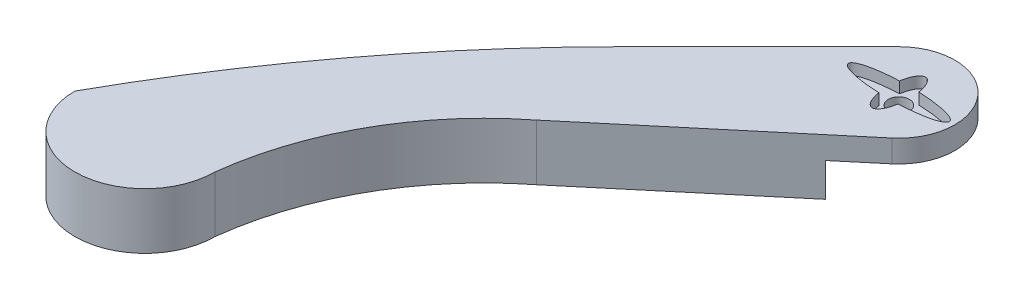
ISO-10303-21;
HEADER;
FILE_DESCRIPTION(('STEP AP214'),'2;1');
FILE_NAME('part.step','',(''),(''),'','','');
FILE_SCHEMA(('AUTOMOTIVE_DESIGN { 1 0 10303 214 1 1 1 1 }'));
ENDSEC;
DATA;
#1=APPLICATION_CONTEXT('core data for automotive mechanical design processes');
#2=APPLICATION_PROTOCOL_DEFINITION('international standard','automotive_design',2000,#1);
#3=PRODUCT_CONTEXT('',#1,'mechanical');
#4=PRODUCT('Part','Part','',(#3));
#5=PRODUCT_RELATED_PRODUCT_CATEGORY('part','',(#4));
#6=PRODUCT_DEFINITION_FORMATION('','',#4);
#7=PRODUCT_DEFINITION_CONTEXT('part definition',#1,'design');
#8=PRODUCT_DEFINITION('design','',#6,#7);
#9=PRODUCT_DEFINITION_SHAPE('','',#8);
#10=(LENGTH_UNIT() NAMED_UNIT(*) SI_UNIT(.MILLI.,.METRE.));
#11=(NAMED_UNIT(*) PLANE_ANGLE_UNIT() SI_UNIT($,.RADIAN.));
#12=(NAMED_UNIT(*) SI_UNIT($,.STERADIAN.) SOLID_ANGLE_UNIT());
#13=UNCERTAINTY_MEASURE_WITH_UNIT(LENGTH_MEASURE(1.E-05),#10,'distance_accuracy_value','');
#14=(GEOMETRIC_REPRESENTATION_CONTEXT(3) GLOBAL_UNCERTAINTY_ASSIGNED_CONTEXT((#13)) GLOBAL_UNIT_ASSIGNED_CONTEXT((#10,
#11,#12)) REPRESENTATION_CONTEXT('',''));
#15=CARTESIAN_POINT('',(0.,0.,0.));
#16=DIRECTION('',(0.,0.,1.));
#17=DIRECTION('',(1.,0.,0.));
#18=AXIS2_PLACEMENT_3D('',#15,#16,#17);
#19=CARTESIAN_POINT('',(0.,10.,0.));
#20=DIRECTION('',(0.,-1.,0.));
#21=DIRECTION('',(0.,0.,-1.));
#22=AXIS2_PLACEMENT_3D('',#19,#20,#21);
#23=CYLINDRICAL_SURFACE('',#22,20.);
#24=CARTESIAN_POINT('',(0.,2.,0.));
#25=DIRECTION('',(0.,-1.,0.));
#26=DIRECTION('',(0.,0.,-1.));
#27=AXIS2_PLACEMENT_3D('',#24,#25,#26);
#28=CIRCLE('',#27,20.);
#29=CARTESIAN_POINT('',(-14.1421356237309,2.,-14.142135623731));
#30=VERTEX_POINT('',#29);
#31=CARTESIAN_POINT('',(12.8557521937307,2.,15.3208888623796));
#32=VERTEX_POINT('',#31);
#33=EDGE_CURVE('E129',#30,#32,#28,.T.);
#34=ORIENTED_EDGE('',*,*,#33,.F.);
#35=DIRECTION('',(0.,-1.,0.));
#36=VECTOR('',#35,1.);
#37=CARTESIAN_POINT('',(-14.1421356237309,10.,-14.142135623731));
#38=LINE('',#37,#36);
#39=CARTESIAN_POINT('',(-14.1421356237309,10.,-14.142135623731));
#40=VERTEX_POINT('',#39);
#41=EDGE_CURVE('E155',#40,#30,#38,.T.);
#42=ORIENTED_EDGE('',*,*,#41,.F.);
#43=CARTESIAN_POINT('',(0.,10.,0.));
#44=DIRECTION('',(0.,1.,0.));
#45=DIRECTION('',(0.,0.,1.));
#46=AXIS2_PLACEMENT_3D('',#43,#44,#45);
#47=CIRCLE('',#46,20.);
#48=CARTESIAN_POINT('',(12.8557521937307,10.,15.3208888623796));
#49=VERTEX_POINT('',#48);
#50=EDGE_CURVE('E151',#49,#40,#47,.T.);
#51=ORIENTED_EDGE('',*,*,#50,.F.);
#52=DIRECTION('',(0.,-1.,0.));
#53=VECTOR('',#52,1.);
#54=CARTESIAN_POINT('',(12.8557521937307,10.,15.3208888623796));
#55=LINE('',#54,#53);
#56=EDGE_CURVE('E144',#49,#32,#55,.T.);
#57=ORIENTED_EDGE('',*,*,#56,.T.);
#58=EDGE_LOOP('',(#34,#42,#51,#57));
#59=FACE_BOUND('',#58,.T.);
#60=ADVANCED_FACE('F38',(#59),#23,.T.);
#61=CARTESIAN_POINT('',(0.,10.000012,0.));
#62=DIRECTION('',(0.,-1.,0.));
#63=DIRECTION('',(0.,0.,-1.));
#64=AXIS2_PLACEMENT_3D('',#61,#62,#63);
#65=CYLINDRICAL_SURFACE('',#64,3.75);
#66=CARTESIAN_POINT('',(0.,6.,0.));
#67=DIRECTION('',(0.,-1.,0.));
#68=DIRECTION('',(0.,0.,-1.));
#69=AXIS2_PLACEMENT_3D('',#66,#67,#68);
#70=CIRCLE('',#69,3.75);
#71=CARTESIAN_POINT('',(0.,6.,-3.75));
#72=VERTEX_POINT('',#71);
#73=EDGE_CURVE('E176',#72,#72,#70,.F.);
#74=ORIENTED_EDGE('',*,*,#73,.T.);
#75=EDGE_LOOP('',(#74));
#76=FACE_BOUND('',#75,.T.);
#77=CARTESIAN_POINT('',(0.,2.,0.));
#78=DIRECTION('',(0.,-1.,0.));
#79=DIRECTION('',(0.,0.,-1.));
#80=AXIS2_PLACEMENT_3D('',#77,#78,#79);
#81=CIRCLE('',#80,3.75);
#82=CARTESIAN_POINT('',(0.,2.,-3.75));
#83=VERTEX_POINT('',#82);
#84=EDGE_CURVE('E42',#83,#83,#81,.F.);
#85=ORIENTED_EDGE('',*,*,#84,.F.);
#86=EDGE_LOOP('',(#85));
#87=FACE_BOUND('',#86,.T.);
#88=ADVANCED_FACE('F291',(#76,#87),#65,.F.);
#89=CARTESIAN_POINT('',(-14.1421356237309,10.,-14.142135623731));
#90=DIRECTION('',(0.707106781186548,0.,0.707106781186547));
#91=DIRECTION('',(0.707106781186547,0.,-0.707106781186548));
#92=AXIS2_PLACEMENT_3D('',#89,#90,#91);
#93=PLANE('',#92);
#94=DIRECTION('',(0.707106781186547,0.,-0.707106781186548));
#95=VECTOR('',#94,1.);
#96=CARTESIAN_POINT('',(-14.1421356237309,2.,-14.142135623731));
#97=LINE('',#96,#95);
#98=CARTESIAN_POINT('',(-54.7968039019934,2.,26.5125326545314));
#99=VERTEX_POINT('',#98);
#100=EDGE_CURVE('E134',#99,#30,#97,.T.);
#101=ORIENTED_EDGE('',*,*,#100,.F.);
#102=DIRECTION('',(0.,-1.,0.));
#103=VECTOR('',#102,1.);
#104=CARTESIAN_POINT('',(-54.7968039019934,2.,26.5125326545314));
#105=LINE('',#104,#103);
#106=CARTESIAN_POINT('',(-54.7968039019934,-10.,26.5125326545314));
#107=VERTEX_POINT('',#106);
#108=EDGE_CURVE('E267',#99,#107,#105,.T.);
#109=ORIENTED_EDGE('',*,*,#108,.T.);
#110=DIRECTION('',(-0.707106781186547,0.,0.707106781186548));
#111=VECTOR('',#110,1.);
#112=CARTESIAN_POINT('',(-14.1421356237309,-10.,-14.142135623731));
#113=LINE('',#112,#111);
#114=CARTESIAN_POINT('',(-63.6396103067893,-10.,35.3553390593272));
#115=VERTEX_POINT('',#114);
#116=EDGE_CURVE('E180',#107,#115,#113,.T.);
#117=ORIENTED_EDGE('',*,*,#116,.T.);
#118=DIRECTION('',(0.,-1.,0.));
#119=VECTOR('',#118,1.);
#120=CARTESIAN_POINT('',(-63.6396103067893,10.,35.3553390593272));
#121=LINE('',#120,#119);
#122=CARTESIAN_POINT('',(-63.6396103067893,10.,35.3553390593272));
#123=VERTEX_POINT('',#122);
#124=EDGE_CURVE('E171',#123,#115,#121,.T.);
#125=ORIENTED_EDGE('',*,*,#124,.F.);
#126=DIRECTION('',(-0.707106781186547,0.,0.707106781186548));
#127=VECTOR('',#126,1.);
#128=CARTESIAN_POINT('',(-14.1421356237309,10.,-14.142135623731));
#129=LINE('',#128,#127);
#130=EDGE_CURVE('E213',#40,#123,#129,.T.);
#131=ORIENTED_EDGE('',*,*,#130,.F.);
#132=ORIENTED_EDGE('',*,*,#41,.T.);
#133=EDGE_LOOP('',(#101,#109,#117,#125,#131,#132));
#134=FACE_BOUND('',#133,.T.);
#135=ADVANCED_FACE('F40',(#134),#93,.F.);
#136=CARTESIAN_POINT('',(289.913780286484,10.,388.908729652601));
#137=DIRECTION('',(0.,-1.,0.));
#138=DIRECTION('',(0.,0.,-1.));
#139=AXIS2_PLACEMENT_3D('',#136,#137,#138);
#140=CYLINDRICAL_SURFACE('',#139,500.);
#141=CARTESIAN_POINT('',(289.913780286484,-10.,388.908729652601));
#142=DIRECTION('',(0.,1.,0.));
#143=DIRECTION('',(0.,0.,1.));
#144=AXIS2_PLACEMENT_3D('',#141,#142,#143);
#145=CIRCLE('',#144,500.);
#146=CARTESIAN_POINT('',(-147.478482249993,-10.,146.652648876037));
#147=VERTEX_POINT('',#146);
#148=EDGE_CURVE('E235',#115,#147,#145,.T.);
#149=ORIENTED_EDGE('',*,*,#148,.T.);
#150=DIRECTION('',(0.,-1.,0.));
#151=VECTOR('',#150,1.);
#152=CARTESIAN_POINT('',(-147.478482249993,10.,146.652648876037));
#153=LINE('',#152,#151);
#154=CARTESIAN_POINT('',(-147.478482249993,10.,146.652648876037));
#155=VERTEX_POINT('',#154);
#156=EDGE_CURVE('E167',#155,#147,#153,.T.);
#157=ORIENTED_EDGE('',*,*,#156,.F.);
#158=CARTESIAN_POINT('',(289.913780286484,10.,388.908729652601));
#159=DIRECTION('',(0.,1.,0.));
#160=DIRECTION('',(0.,0.,1.));
#161=AXIS2_PLACEMENT_3D('',#158,#159,#160);
#162=CIRCLE('',#161,500.);
#163=EDGE_CURVE('E217',#123,#155,#162,.T.);
#164=ORIENTED_EDGE('',*,*,#163,.F.);
#165=ORIENTED_EDGE('',*,*,#124,.T.);
#166=EDGE_LOOP('',(#149,#157,#164,#165));
#167=FACE_BOUND('',#166,.T.);
#168=ADVANCED_FACE('F262',(#167),#140,.T.);
#169=CARTESIAN_POINT('',(-122.478482249993,10.,146.652648876037));
#170=DIRECTION('',(0.,-1.,0.));
#171=DIRECTION('',(0.,0.,-1.));
#172=AXIS2_PLACEMENT_3D('',#169,#170,#171);
#173=CYLINDRICAL_SURFACE('',#172,25.);
#174=CARTESIAN_POINT('',(-122.478482249993,-10.,146.652648876037));
#175=DIRECTION('',(0.,1.,0.));
#176=DIRECTION('',(0.,0.,1.));
#177=AXIS2_PLACEMENT_3D('',#174,#175,#176);
#178=CIRCLE('',#177,25.);
#179=CARTESIAN_POINT('',(-97.4784822499933,-10.,146.652648876037));
#180=VERTEX_POINT('',#179);
#181=EDGE_CURVE('E238',#147,#180,#178,.T.);
#182=ORIENTED_EDGE('',*,*,#181,.T.);
#183=DIRECTION('',(0.,-1.,0.));
#184=VECTOR('',#183,1.);
#185=CARTESIAN_POINT('',(-97.4784822499933,10.,146.652648876037));
#186=LINE('',#185,#184);
#187=CARTESIAN_POINT('',(-97.4784822499933,10.,146.652648876037));
#188=VERTEX_POINT('',#187);
#189=EDGE_CURVE('E160',#188,#180,#186,.T.);
#190=ORIENTED_EDGE('',*,*,#189,.F.);
#191=CARTESIAN_POINT('',(-122.478482249993,10.,146.652648876037));
#192=DIRECTION('',(0.,1.,0.));
#193=DIRECTION('',(0.,0.,1.));
#194=AXIS2_PLACEMENT_3D('',#191,#192,#193);
#195=CIRCLE('',#194,25.);
#196=EDGE_CURVE('E221',#155,#188,#195,.T.);
#197=ORIENTED_EDGE('',*,*,#196,.F.);
#198=ORIENTED_EDGE('',*,*,#156,.T.);
#199=EDGE_LOOP('',(#182,#190,#197,#198));
#200=FACE_BOUND('',#199,.T.);
#201=ADVANCED_FACE('F257',(#200),#173,.T.);
#202=CARTESIAN_POINT('',(11.7361932959104,10.,159.773420400722));
#203=DIRECTION('',(0.,-1.,0.));
#204=DIRECTION('',(0.,0.,-1.));
#205=AXIS2_PLACEMENT_3D('',#202,#203,#204);
#206=CYLINDRICAL_SURFACE('',#205,110.);
#207=CARTESIAN_POINT('',(11.7361932959104,-10.,159.773420400722));
#208=DIRECTION('',(0.,1.,0.));
#209=DIRECTION('',(0.,0.,1.));
#210=AXIS2_PLACEMENT_3D('',#207,#208,#209);
#211=CIRCLE('',#210,110.);
#212=CARTESIAN_POINT('',(-56.0882476869776,-10.,73.1717737341677));
#213=VERTEX_POINT('',#212);
#214=EDGE_CURVE('E242',#213,#180,#211,.T.);
#215=ORIENTED_EDGE('',*,*,#214,.F.);
#216=DIRECTION('',(0.,-1.,0.));
#217=VECTOR('',#216,1.);
#218=CARTESIAN_POINT('',(-56.0882476869776,10.,73.1717737341677));
#219=LINE('',#218,#217);
#220=CARTESIAN_POINT('',(-56.0882476869776,10.,73.1717737341677));
#221=VERTEX_POINT('',#220);
#222=EDGE_CURVE('E154',#221,#213,#219,.T.);
#223=ORIENTED_EDGE('',*,*,#222,.F.);
#224=CARTESIAN_POINT('',(11.7361932959104,10.,159.773420400722));
#225=DIRECTION('',(0.,1.,0.));
#226=DIRECTION('',(0.,0.,1.));
#227=AXIS2_PLACEMENT_3D('',#224,#225,#226);
#228=CIRCLE('',#227,110.);
#229=EDGE_CURVE('E224',#221,#188,#228,.T.);
#230=ORIENTED_EDGE('',*,*,#229,.T.);
#231=ORIENTED_EDGE('',*,*,#189,.T.);
#232=EDGE_LOOP('',(#215,#223,#230,#231));
#233=FACE_BOUND('',#232,.T.);
#234=ADVANCED_FACE('F253',(#233),#206,.F.);
#235=CARTESIAN_POINT('',(12.8557521937307,10.,15.3208888623796));
#236=DIRECTION('',(0.642787609686535,0.,0.766044443118982));
#237=DIRECTION('',(0.766044443118982,0.,-0.642787609686535));
#238=AXIS2_PLACEMENT_3D('',#235,#236,#237);
#239=PLANE('',#238);
#240=DIRECTION('',(0.,-1.,0.));
#241=VECTOR('',#240,1.);
#242=CARTESIAN_POINT('',(0.,2.,26.1081457866455));
#243=LINE('',#242,#241);
#244=CARTESIAN_POINT('',(0.,2.,26.1081457866455));
#245=VERTEX_POINT('',#244);
#246=CARTESIAN_POINT('',(0.,-10.,26.1081457866455));
#247=VERTEX_POINT('',#246);
#248=EDGE_CURVE('E55',#245,#247,#243,.T.);
#249=ORIENTED_EDGE('',*,*,#248,.F.);
#250=DIRECTION('',(0.766044443118982,0.,-0.642787609686535));
#251=VECTOR('',#250,1.);
#252=CARTESIAN_POINT('',(0.,2.,26.1081457866455));
#253=LINE('',#252,#251);
#254=EDGE_CURVE('E133',#245,#32,#253,.T.);
#255=ORIENTED_EDGE('',*,*,#254,.T.);
#256=ORIENTED_EDGE('',*,*,#56,.F.);
#257=DIRECTION('',(-0.766044443118982,0.,0.642787609686535));
#258=VECTOR('',#257,1.);
#259=CARTESIAN_POINT('',(12.8557521937307,10.,15.3208888623796));
#260=LINE('',#259,#258);
#261=EDGE_CURVE('E228',#49,#221,#260,.T.);
#262=ORIENTED_EDGE('',*,*,#261,.T.);
#263=ORIENTED_EDGE('',*,*,#222,.T.);
#264=DIRECTION('',(-0.766044443118982,0.,0.642787609686535));
#265=VECTOR('',#264,1.);
#266=CARTESIAN_POINT('',(12.8557521937307,-10.,15.3208888623796));
#267=LINE('',#266,#265);
#268=EDGE_CURVE('E218',#247,#213,#267,.T.);
#269=ORIENTED_EDGE('',*,*,#268,.F.);
#270=EDGE_LOOP('',(#249,#255,#256,#262,#263,#269));
#271=FACE_BOUND('',#270,.T.);
#272=ADVANCED_FACE('F142',(#271),#239,.T.);
#273=CARTESIAN_POINT('',(289.913780286484,10.,388.908729652601));
#274=DIRECTION('',(0.,1.,0.));
#275=DIRECTION('',(0.,0.,1.));
#276=AXIS2_PLACEMENT_3D('',#273,#274,#275);
#277=PLANE('',#276);
#278=CARTESIAN_POINT('',(0.,10.,0.));
#279=DIRECTION('',(0.,-1.,0.));
#280=DIRECTION('',(-1.,0.,0.));
#281=AXIS2_PLACEMENT_3D('',#278,#279,#280);
#282=ELLIPSE('',#281,18.,3.75);
#283=CARTESIAN_POINT('',(-3.45718847790825,10.,3.68018252201192));
#284=VERTEX_POINT('',#283);
#285=CARTESIAN_POINT('',(-3.45718847790824,10.,-3.68018252201192));
#286=VERTEX_POINT('',#285);
#287=EDGE_CURVE('E175',#284,#286,#282,.T.);
#288=ORIENTED_EDGE('',*,*,#287,.T.);
#289=CARTESIAN_POINT('',(0.,10.,0.));
#290=DIRECTION('',(0.,-1.,0.));
#291=DIRECTION('',(0.,0.,-1.));
#292=AXIS2_PLACEMENT_3D('',#289,#290,#291);
#293=ELLIPSE('',#292,9.5,3.75);
#294=CARTESIAN_POINT('',(3.45718847790824,10.,-3.68018252201192));
#295=VERTEX_POINT('',#294);
#296=EDGE_CURVE('E11',#286,#295,#293,.T.);
#297=ORIENTED_EDGE('',*,*,#296,.T.);
#298=CARTESIAN_POINT('',(0.,10.,0.));
#299=DIRECTION('',(0.,-1.,0.));
#300=DIRECTION('',(-1.,0.,0.));
#301=AXIS2_PLACEMENT_3D('',#298,#299,#300);
#302=ELLIPSE('',#301,18.,3.75);
#303=CARTESIAN_POINT('',(3.45718847790824,10.,3.68018252201192));
#304=VERTEX_POINT('',#303);
#305=EDGE_CURVE('E48',#295,#304,#302,.T.);
#306=ORIENTED_EDGE('',*,*,#305,.T.);
#307=CARTESIAN_POINT('',(0.,10.,0.));
#308=DIRECTION('',(0.,-1.,0.));
#309=DIRECTION('',(0.,0.,-1.));
#310=AXIS2_PLACEMENT_3D('',#307,#308,#309);
#311=ELLIPSE('',#310,9.5,3.75);
#312=EDGE_CURVE('E185',#304,#284,#311,.T.);
#313=ORIENTED_EDGE('',*,*,#312,.T.);
#314=EDGE_LOOP('',(#288,#297,#306,#313));
#315=FACE_BOUND('',#314,.T.);
#316=ORIENTED_EDGE('',*,*,#130,.T.);
#317=ORIENTED_EDGE('',*,*,#163,.T.);
#318=ORIENTED_EDGE('',*,*,#196,.T.);
#319=ORIENTED_EDGE('',*,*,#229,.F.);
#320=ORIENTED_EDGE('',*,*,#261,.F.);
#321=ORIENTED_EDGE('',*,*,#50,.T.);
#322=EDGE_LOOP('',(#316,#317,#318,#319,#320,#321));
#323=FACE_BOUND('',#322,.T.);
#324=ADVANCED_FACE('F192',(#315,#323),#277,.T.);
#325=CARTESIAN_POINT('',(289.913780286484,-10.,388.908729652601));
#326=DIRECTION('',(0.,1.,0.));
#327=DIRECTION('',(0.,0.,1.));
#328=AXIS2_PLACEMENT_3D('',#325,#326,#327);
#329=PLANE('',#328);
#330=ORIENTED_EDGE('',*,*,#116,.F.);
#331=DIRECTION('',(-0.999972770736379,0.,0.00737955187044446));
#332=VECTOR('',#331,1.);
#333=CARTESIAN_POINT('',(0.,-10.,26.1081457866455));
#334=LINE('',#333,#332);
#335=EDGE_CURVE('E149',#247,#107,#334,.T.);
#336=ORIENTED_EDGE('',*,*,#335,.F.);
#337=ORIENTED_EDGE('',*,*,#268,.T.);
#338=ORIENTED_EDGE('',*,*,#214,.T.);
#339=ORIENTED_EDGE('',*,*,#181,.F.);
#340=ORIENTED_EDGE('',*,*,#148,.F.);
#341=EDGE_LOOP('',(#330,#336,#337,#338,#339,#340));
#342=FACE_BOUND('',#341,.T.);
#343=ADVANCED_FACE('F248',(#342),#329,.F.);
#344=CARTESIAN_POINT('',(0.,6.,0.));
#345=DIRECTION('',(0.,-1.,0.));
#346=DIRECTION('',(0.,0.,-1.));
#347=AXIS2_PLACEMENT_3D('',#344,#345,#346);
#348=PLANE('',#347);
#349=CARTESIAN_POINT('',(0.,6.,0.));
#350=DIRECTION('',(0.,-1.,0.));
#351=DIRECTION('',(0.,0.,-1.));
#352=AXIS2_PLACEMENT_3D('',#349,#350,#351);
#353=ELLIPSE('',#352,9.5,3.75);
#354=CARTESIAN_POINT('',(-3.45718847790824,6.,-3.68018252201192));
#355=VERTEX_POINT('',#354);
#356=CARTESIAN_POINT('',(3.45718847790824,6.,-3.68018252201192));
#357=VERTEX_POINT('',#356);
#358=EDGE_CURVE('E205',#355,#357,#353,.T.);
#359=ORIENTED_EDGE('',*,*,#358,.F.);
#360=CARTESIAN_POINT('',(0.,6.,0.));
#361=DIRECTION('',(0.,-1.,0.));
#362=DIRECTION('',(-1.,0.,0.));
#363=AXIS2_PLACEMENT_3D('',#360,#361,#362);
#364=ELLIPSE('',#363,18.,3.75);
#365=CARTESIAN_POINT('',(-3.45718847790825,6.,3.68018252201192));
#366=VERTEX_POINT('',#365);
#367=EDGE_CURVE('E352',#366,#355,#364,.T.);
#368=ORIENTED_EDGE('',*,*,#367,.F.);
#369=CARTESIAN_POINT('',(0.,6.,0.));
#370=DIRECTION('',(0.,-1.,0.));
#371=DIRECTION('',(0.,0.,-1.));
#372=AXIS2_PLACEMENT_3D('',#369,#370,#371);
#373=ELLIPSE('',#372,9.5,3.75);
#374=CARTESIAN_POINT('',(3.45718847790824,6.,3.68018252201192));
#375=VERTEX_POINT('',#374);
#376=EDGE_CURVE('E356',#375,#366,#373,.T.);
#377=ORIENTED_EDGE('',*,*,#376,.F.);
#378=CARTESIAN_POINT('',(0.,6.,0.));
#379=DIRECTION('',(0.,-1.,0.));
#380=DIRECTION('',(-1.,0.,0.));
#381=AXIS2_PLACEMENT_3D('',#378,#379,#380);
#382=ELLIPSE('',#381,18.,3.75);
#383=EDGE_CURVE('E282',#357,#375,#382,.T.);
#384=ORIENTED_EDGE('',*,*,#383,.F.);
#385=EDGE_LOOP('',(#359,#368,#377,#384));
#386=FACE_BOUND('',#385,.T.);
#387=ORIENTED_EDGE('',*,*,#73,.F.);
#388=EDGE_LOOP('',(#387));
#389=FACE_BOUND('',#388,.T.);
#390=ADVANCED_FACE('F289',(#386,#389),#348,.F.);
#391=DIRECTION('',(0.,1.,0.));
#392=VECTOR('',#391,1.);
#393=SURFACE_OF_LINEAR_EXTRUSION('',#353,#392);
#394=DIRECTION('',(0.,1.,0.));
#395=VECTOR('',#394,1.);
#396=CARTESIAN_POINT('',(-3.45718847790824,6.,-3.68018252201192));
#397=LINE('',#396,#395);
#398=EDGE_CURVE('E63',#355,#286,#397,.T.);
#399=ORIENTED_EDGE('',*,*,#398,.F.);
#400=ORIENTED_EDGE('',*,*,#358,.T.);
#401=DIRECTION('',(0.,1.,0.));
#402=VECTOR('',#401,1.);
#403=CARTESIAN_POINT('',(3.45718847790824,6.,-3.68018252201192));
#404=LINE('',#403,#402);
#405=EDGE_CURVE('E181',#357,#295,#404,.T.);
#406=ORIENTED_EDGE('',*,*,#405,.T.);
#407=ORIENTED_EDGE('',*,*,#296,.F.);
#408=EDGE_LOOP('',(#399,#400,#406,#407));
#409=FACE_BOUND('',#408,.T.);
#410=ADVANCED_FACE('F203',(#409),#393,.T.);
#411=DIRECTION('',(0.,1.,0.));
#412=VECTOR('',#411,1.);
#413=SURFACE_OF_LINEAR_EXTRUSION('',#382,#412);
#414=ORIENTED_EDGE('',*,*,#405,.F.);
#415=ORIENTED_EDGE('',*,*,#383,.T.);
#416=DIRECTION('',(0.,1.,0.));
#417=VECTOR('',#416,1.);
#418=CARTESIAN_POINT('',(3.45718847790824,6.,3.68018252201192));
#419=LINE('',#418,#417);
#420=EDGE_CURVE('E200',#375,#304,#419,.T.);
#421=ORIENTED_EDGE('',*,*,#420,.T.);
#422=ORIENTED_EDGE('',*,*,#305,.F.);
#423=EDGE_LOOP('',(#414,#415,#421,#422));
#424=FACE_BOUND('',#423,.T.);
#425=ADVANCED_FACE('F198',(#424),#413,.T.);
#426=DIRECTION('',(0.,1.,0.));
#427=VECTOR('',#426,1.);
#428=SURFACE_OF_LINEAR_EXTRUSION('',#373,#427);
#429=ORIENTED_EDGE('',*,*,#420,.F.);
#430=ORIENTED_EDGE('',*,*,#376,.T.);
#431=DIRECTION('',(0.,1.,0.));
#432=VECTOR('',#431,1.);
#433=CARTESIAN_POINT('',(-3.45718847790825,6.,3.68018252201192));
#434=LINE('',#433,#432);
#435=EDGE_CURVE('E209',#366,#284,#434,.T.);
#436=ORIENTED_EDGE('',*,*,#435,.T.);
#437=ORIENTED_EDGE('',*,*,#312,.F.);
#438=EDGE_LOOP('',(#429,#430,#436,#437));
#439=FACE_BOUND('',#438,.T.);
#440=ADVANCED_FACE('F351',(#439),#428,.T.);
#441=DIRECTION('',(0.,1.,0.));
#442=VECTOR('',#441,1.);
#443=SURFACE_OF_LINEAR_EXTRUSION('',#364,#442);
#444=ORIENTED_EDGE('',*,*,#435,.F.);
#445=ORIENTED_EDGE('',*,*,#367,.T.);
#446=ORIENTED_EDGE('',*,*,#398,.T.);
#447=ORIENTED_EDGE('',*,*,#287,.F.);
#448=EDGE_LOOP('',(#444,#445,#446,#447));
#449=FACE_BOUND('',#448,.T.);
#450=ADVANCED_FACE('F331',(#449),#443,.T.);
#451=CARTESIAN_POINT('',(-0.00640941739439777,2.,-0.00763844620621827));
#452=DIRECTION('',(0.,-1.,0.));
#453=DIRECTION('',(0.,0.,-1.));
#454=AXIS2_PLACEMENT_3D('',#451,#452,#453);
#455=PLANE('',#454);
#456=ORIENTED_EDGE('',*,*,#84,.T.);
#457=EDGE_LOOP('',(#456));
#458=FACE_BOUND('',#457,.T.);
#459=ORIENTED_EDGE('',*,*,#100,.T.);
#460=ORIENTED_EDGE('',*,*,#33,.T.);
#461=ORIENTED_EDGE('',*,*,#254,.F.);
#462=DIRECTION('',(-0.999972770736379,0.,0.00737955187044446));
#463=VECTOR('',#462,1.);
#464=CARTESIAN_POINT('',(0.,2.,26.1081457866455));
#465=LINE('',#464,#463);
#466=EDGE_CURVE('E148',#245,#99,#465,.T.);
#467=ORIENTED_EDGE('',*,*,#466,.T.);
#468=EDGE_LOOP('',(#459,#460,#461,#467));
#469=FACE_BOUND('',#468,.T.);
#470=ADVANCED_FACE('F131',(#458,#469),#455,.T.);
#471=CARTESIAN_POINT('',(0.,2.,26.1081457866455));
#472=DIRECTION('',(0.00737955187044446,0.,0.999972770736379));
#473=DIRECTION('',(0.999972770736379,0.,-0.00737955187044446));
#474=AXIS2_PLACEMENT_3D('',#471,#472,#473);
#475=PLANE('',#474);
#476=ORIENTED_EDGE('',*,*,#335,.T.);
#477=ORIENTED_EDGE('',*,*,#108,.F.);
#478=ORIENTED_EDGE('',*,*,#466,.F.);
#479=ORIENTED_EDGE('',*,*,#248,.T.);
#480=EDGE_LOOP('',(#476,#477,#478,#479));
#481=FACE_BOUND('',#480,.T.);
#482=ADVANCED_FACE('F330',(#481),#475,.F.);
#483=CLOSED_SHELL('',(#60,#88,#135,#168,#201,#234,#272,#324,#343,#390,#410,#425,#440,#450,#470,#482));
#484=MANIFOLD_SOLID_BREP('B2',#483);
#485=ADVANCED_BREP_SHAPE_REPRESENTATION('',(#18,#484),#14);
#486=SHAPE_DEFINITION_REPRESENTATION(#9,#485);
ENDSEC;
END-ISO-10303-21;
